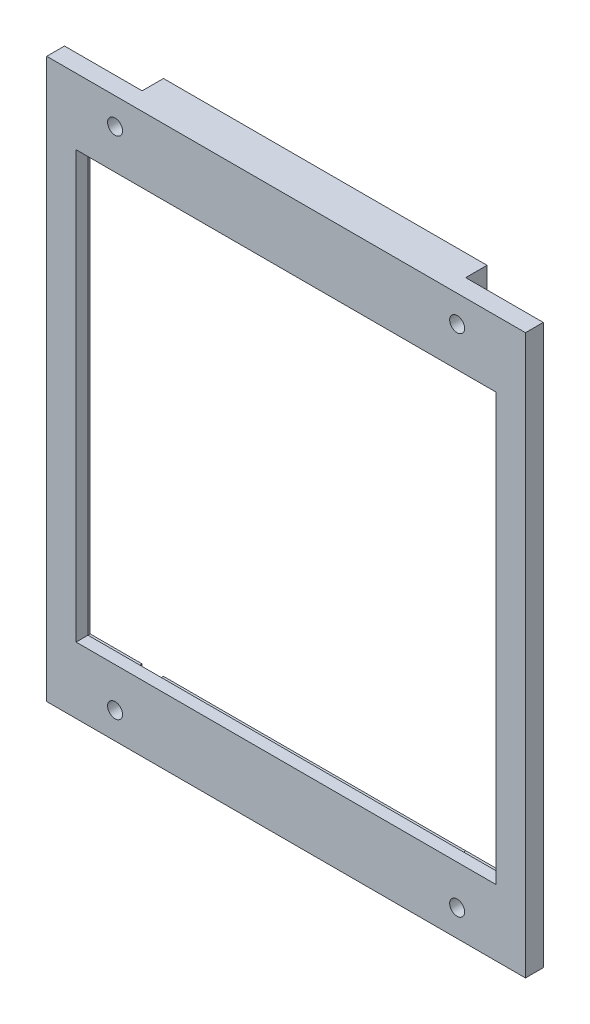
ISO-10303-21;
HEADER;
FILE_DESCRIPTION(('STEP AP214'),'2;1');
FILE_NAME('part.step','',(''),(''),'','','');
FILE_SCHEMA(('AUTOMOTIVE_DESIGN { 1 0 10303 214 1 1 1 1 }'));
ENDSEC;
DATA;
#1=APPLICATION_CONTEXT('core data for automotive mechanical design processes');
#2=APPLICATION_PROTOCOL_DEFINITION('international standard','automotive_design',2000,#1);
#3=PRODUCT_CONTEXT('',#1,'mechanical');
#4=PRODUCT('Part','Part','',(#3));
#5=PRODUCT_RELATED_PRODUCT_CATEGORY('part','',(#4));
#6=PRODUCT_DEFINITION_FORMATION('','',#4);
#7=PRODUCT_DEFINITION_CONTEXT('part definition',#1,'design');
#8=PRODUCT_DEFINITION('design','',#6,#7);
#9=PRODUCT_DEFINITION_SHAPE('','',#8);
#10=(LENGTH_UNIT() NAMED_UNIT(*) SI_UNIT(.MILLI.,.METRE.));
#11=(NAMED_UNIT(*) PLANE_ANGLE_UNIT() SI_UNIT($,.RADIAN.));
#12=(NAMED_UNIT(*) SI_UNIT($,.STERADIAN.) SOLID_ANGLE_UNIT());
#13=UNCERTAINTY_MEASURE_WITH_UNIT(LENGTH_MEASURE(1.E-05),#10,'distance_accuracy_value','');
#14=(GEOMETRIC_REPRESENTATION_CONTEXT(3) GLOBAL_UNCERTAINTY_ASSIGNED_CONTEXT((#13)) GLOBAL_UNIT_ASSIGNED_CONTEXT((#10,
#11,#12)) REPRESENTATION_CONTEXT('',''));
#15=CARTESIAN_POINT('',(0.,0.,0.));
#16=DIRECTION('',(0.,0.,1.));
#17=DIRECTION('',(1.,0.,0.));
#18=AXIS2_PLACEMENT_3D('',#15,#16,#17);
#19=CARTESIAN_POINT('',(0.,0.,6.1));
#20=DIRECTION('',(0.,0.,-1.));
#21=DIRECTION('',(-1.,0.,0.));
#22=AXIS2_PLACEMENT_3D('',#19,#20,#21);
#23=PLANE('',#22);
#24=DIRECTION('',(1.,0.,0.));
#25=VECTOR('',#24,1.);
#26=CARTESIAN_POINT('',(-60.025,60.925,6.1));
#27=LINE('',#26,#25);
#28=CARTESIAN_POINT('',(45.4728837140189,60.925,6.1));
#29=VERTEX_POINT('',#28);
#30=CARTESIAN_POINT('',(60.025,60.925,6.1));
#31=VERTEX_POINT('',#30);
#32=EDGE_CURVE('E262',#29,#31,#27,.T.);
#33=ORIENTED_EDGE('',*,*,#32,.F.);
#34=DIRECTION('',(0.,-1.,0.));
#35=VECTOR('',#34,1.);
#36=CARTESIAN_POINT('',(45.4728837140189,60.9,6.1));
#37=LINE('',#36,#35);
#38=CARTESIAN_POINT('',(45.4728837140189,66.95,6.1));
#39=VERTEX_POINT('',#38);
#40=EDGE_CURVE('E386',#39,#29,#37,.T.);
#41=ORIENTED_EDGE('',*,*,#40,.F.);
#42=DIRECTION('',(1.,0.,0.));
#43=VECTOR('',#42,1.);
#44=CARTESIAN_POINT('',(45.4728837140189,66.95,6.1));
#45=LINE('',#44,#43);
#46=CARTESIAN_POINT('',(45.45,66.95,6.1));
#47=VERTEX_POINT('',#46);
#48=EDGE_CURVE('E394',#47,#39,#45,.T.);
#49=ORIENTED_EDGE('',*,*,#48,.F.);
#50=DIRECTION('',(0.,-1.,0.));
#51=VECTOR('',#50,1.);
#52=CARTESIAN_POINT('',(45.45,78.5,6.09999999999999));
#53=LINE('',#52,#51);
#54=CARTESIAN_POINT('',(45.45,78.5,6.1));
#55=VERTEX_POINT('',#54);
#56=EDGE_CURVE('E313',#55,#47,#53,.T.);
#57=ORIENTED_EDGE('',*,*,#56,.F.);
#58=DIRECTION('',(-1.,0.,0.));
#59=VECTOR('',#58,1.);
#60=CARTESIAN_POINT('',(-67.2500000000002,78.5,6.1));
#61=LINE('',#60,#59);
#62=CARTESIAN_POINT('',(67.2500000000001,78.5,6.1));
#63=VERTEX_POINT('',#62);
#64=EDGE_CURVE('E512',#63,#55,#61,.T.);
#65=ORIENTED_EDGE('',*,*,#64,.F.);
#66=DIRECTION('',(0.,1.,0.));
#67=VECTOR('',#66,1.);
#68=CARTESIAN_POINT('',(67.2500000000001,78.5,6.1));
#69=LINE('',#68,#67);
#70=CARTESIAN_POINT('',(67.2500000000001,-78.5,6.1));
#71=VERTEX_POINT('',#70);
#72=EDGE_CURVE('E530',#71,#63,#69,.T.);
#73=ORIENTED_EDGE('',*,*,#72,.F.);
#74=DIRECTION('',(1.,0.,0.));
#75=VECTOR('',#74,1.);
#76=CARTESIAN_POINT('',(-67.2500000000002,-78.5,6.1));
#77=LINE('',#76,#75);
#78=CARTESIAN_POINT('',(45.45,-78.5,6.1));
#79=VERTEX_POINT('',#78);
#80=EDGE_CURVE('E525',#79,#71,#77,.T.);
#81=ORIENTED_EDGE('',*,*,#80,.F.);
#82=DIRECTION('',(0.,-1.,0.));
#83=VECTOR('',#82,1.);
#84=CARTESIAN_POINT('',(45.45,-78.5,6.09999999999999));
#85=LINE('',#84,#83);
#86=CARTESIAN_POINT('',(45.45,-66.95,6.1));
#87=VERTEX_POINT('',#86);
#88=EDGE_CURVE('E314',#87,#79,#85,.T.);
#89=ORIENTED_EDGE('',*,*,#88,.F.);
#90=DIRECTION('',(-1.,0.,0.));
#91=VECTOR('',#90,1.);
#92=CARTESIAN_POINT('',(45.4728837140189,-66.95,6.1));
#93=LINE('',#92,#91);
#94=CARTESIAN_POINT('',(45.4728837140189,-66.95,6.1));
#95=VERTEX_POINT('',#94);
#96=EDGE_CURVE('E443',#95,#87,#93,.T.);
#97=ORIENTED_EDGE('',*,*,#96,.F.);
#98=DIRECTION('',(0.,-1.,0.));
#99=VECTOR('',#98,1.);
#100=CARTESIAN_POINT('',(45.4728837140189,-60.9,6.1));
#101=LINE('',#100,#99);
#102=CARTESIAN_POINT('',(45.4728837140189,-60.925,6.1));
#103=VERTEX_POINT('',#102);
#104=EDGE_CURVE('E440',#103,#95,#101,.T.);
#105=ORIENTED_EDGE('',*,*,#104,.F.);
#106=DIRECTION('',(-1.,0.,0.));
#107=VECTOR('',#106,1.);
#108=CARTESIAN_POINT('',(60.025,-60.925,6.1));
#109=LINE('',#108,#107);
#110=CARTESIAN_POINT('',(60.025,-60.925,6.1));
#111=VERTEX_POINT('',#110);
#112=EDGE_CURVE('E272',#111,#103,#109,.T.);
#113=ORIENTED_EDGE('',*,*,#112,.F.);
#114=DIRECTION('',(0.,-1.,0.));
#115=VECTOR('',#114,1.);
#116=CARTESIAN_POINT('',(60.025,60.925,6.1));
#117=LINE('',#116,#115);
#118=EDGE_CURVE('E238',#31,#111,#117,.T.);
#119=ORIENTED_EDGE('',*,*,#118,.F.);
#120=EDGE_LOOP('',(#33,#41,#49,#57,#65,#73,#81,#89,#97,#105,#113,#119));
#121=FACE_BOUND('',#120,.T.);
#122=CARTESIAN_POINT('',(48.05,70.9904396437336,6.1));
#123=DIRECTION('',(0.,0.,1.));
#124=DIRECTION('',(1.,0.,0.));
#125=AXIS2_PLACEMENT_3D('',#122,#123,#124);
#126=CIRCLE('',#125,2.10000000000038);
#127=CARTESIAN_POINT('',(50.1500000000004,70.9904396437336,6.1));
#128=VERTEX_POINT('',#127);
#129=EDGE_CURVE('E495',#128,#128,#126,.T.);
#130=ORIENTED_EDGE('',*,*,#129,.T.);
#131=EDGE_LOOP('',(#130));
#132=FACE_BOUND('',#131,.T.);
#133=CARTESIAN_POINT('',(48.05,-70.9904396437336,6.1));
#134=DIRECTION('',(0.,0.,1.));
#135=DIRECTION('',(-1.,0.,0.));
#136=AXIS2_PLACEMENT_3D('',#133,#134,#135);
#137=CIRCLE('',#136,2.10000000000038);
#138=CARTESIAN_POINT('',(45.9499999999997,-70.9904396437336,6.1));
#139=VERTEX_POINT('',#138);
#140=EDGE_CURVE('E480',#139,#139,#137,.T.);
#141=ORIENTED_EDGE('',*,*,#140,.T.);
#142=EDGE_LOOP('',(#141));
#143=FACE_BOUND('',#142,.T.);
#144=ADVANCED_FACE('F45',(#121,#132,#143),#23,.T.);
#145=CARTESIAN_POINT('',(-59.,-59.9,11.1));
#146=DIRECTION('',(1.,0.,0.));
#147=DIRECTION('',(0.,0.,-1.));
#148=AXIS2_PLACEMENT_3D('',#145,#146,#147);
#149=PLANE('',#148);
#150=DIRECTION('',(0.,0.,-1.));
#151=VECTOR('',#150,1.);
#152=CARTESIAN_POINT('',(-59.,-59.9,11.1));
#153=LINE('',#152,#151);
#154=CARTESIAN_POINT('',(-59.,-59.9,11.1));
#155=VERTEX_POINT('',#154);
#156=CARTESIAN_POINT('',(-59.,-59.9,7.75));
#157=VERTEX_POINT('',#156);
#158=EDGE_CURVE('E471',#155,#157,#153,.T.);
#159=ORIENTED_EDGE('',*,*,#158,.T.);
#160=DIRECTION('',(0.,1.,0.));
#161=VECTOR('',#160,1.);
#162=CARTESIAN_POINT('',(-59.,-59.9,7.75));
#163=LINE('',#162,#161);
#164=CARTESIAN_POINT('',(-59.,59.9,7.75));
#165=VERTEX_POINT('',#164);
#166=EDGE_CURVE('E309',#157,#165,#163,.T.);
#167=ORIENTED_EDGE('',*,*,#166,.T.);
#168=DIRECTION('',(0.,0.,-1.));
#169=VECTOR('',#168,1.);
#170=CARTESIAN_POINT('',(-59.,59.9,11.1));
#171=LINE('',#170,#169);
#172=CARTESIAN_POINT('',(-59.,59.9,11.1));
#173=VERTEX_POINT('',#172);
#174=EDGE_CURVE('E459',#173,#165,#171,.T.);
#175=ORIENTED_EDGE('',*,*,#174,.F.);
#176=DIRECTION('',(0.,-1.,0.));
#177=VECTOR('',#176,1.);
#178=CARTESIAN_POINT('',(-59.,-59.9,11.1));
#179=LINE('',#178,#177);
#180=EDGE_CURVE('E417',#173,#155,#179,.T.);
#181=ORIENTED_EDGE('',*,*,#180,.T.);
#182=EDGE_LOOP('',(#159,#167,#175,#181));
#183=FACE_BOUND('',#182,.T.);
#184=ADVANCED_FACE('F656',(#183),#149,.T.);
#185=CARTESIAN_POINT('',(-59.,-59.9,11.1));
#186=DIRECTION('',(0.,1.,0.));
#187=DIRECTION('',(0.,0.,1.));
#188=AXIS2_PLACEMENT_3D('',#185,#186,#187);
#189=PLANE('',#188);
#190=DIRECTION('',(0.,0.,-1.));
#191=VECTOR('',#190,1.);
#192=CARTESIAN_POINT('',(59.,-59.9,11.1));
#193=LINE('',#192,#191);
#194=CARTESIAN_POINT('',(59.,-59.9,11.1));
#195=VERTEX_POINT('',#194);
#196=CARTESIAN_POINT('',(59.,-59.9,7.75));
#197=VERTEX_POINT('',#196);
#198=EDGE_CURVE('E467',#195,#197,#193,.T.);
#199=ORIENTED_EDGE('',*,*,#198,.T.);
#200=DIRECTION('',(-1.,0.,0.));
#201=VECTOR('',#200,1.);
#202=CARTESIAN_POINT('',(-59.,-59.9,7.75));
#203=LINE('',#202,#201);
#204=EDGE_CURVE('E305',#197,#157,#203,.T.);
#205=ORIENTED_EDGE('',*,*,#204,.T.);
#206=ORIENTED_EDGE('',*,*,#158,.F.);
#207=DIRECTION('',(1.,0.,0.));
#208=VECTOR('',#207,1.);
#209=CARTESIAN_POINT('',(-59.,-59.9,11.1));
#210=LINE('',#209,#208);
#211=EDGE_CURVE('E449',#155,#195,#210,.T.);
#212=ORIENTED_EDGE('',*,*,#211,.T.);
#213=EDGE_LOOP('',(#199,#205,#206,#212));
#214=FACE_BOUND('',#213,.T.);
#215=ADVANCED_FACE('F660',(#214),#189,.T.);
#216=CARTESIAN_POINT('',(59.,59.9,11.1));
#217=DIRECTION('',(-1.,0.,0.));
#218=DIRECTION('',(0.,0.,1.));
#219=AXIS2_PLACEMENT_3D('',#216,#217,#218);
#220=PLANE('',#219);
#221=DIRECTION('',(0.,0.,-1.));
#222=VECTOR('',#221,1.);
#223=CARTESIAN_POINT('',(59.,59.9,11.1));
#224=LINE('',#223,#222);
#225=CARTESIAN_POINT('',(59.,59.9,11.1));
#226=VERTEX_POINT('',#225);
#227=CARTESIAN_POINT('',(59.,59.9,7.75));
#228=VERTEX_POINT('',#227);
#229=EDGE_CURVE('E463',#226,#228,#224,.T.);
#230=ORIENTED_EDGE('',*,*,#229,.T.);
#231=DIRECTION('',(0.,-1.,0.));
#232=VECTOR('',#231,1.);
#233=CARTESIAN_POINT('',(59.,59.9,7.75));
#234=LINE('',#233,#232);
#235=EDGE_CURVE('E61',#228,#197,#234,.T.);
#236=ORIENTED_EDGE('',*,*,#235,.T.);
#237=ORIENTED_EDGE('',*,*,#198,.F.);
#238=DIRECTION('',(0.,1.,0.));
#239=VECTOR('',#238,1.);
#240=CARTESIAN_POINT('',(59.,59.9,11.1));
#241=LINE('',#240,#239);
#242=EDGE_CURVE('E452',#195,#226,#241,.T.);
#243=ORIENTED_EDGE('',*,*,#242,.T.);
#244=EDGE_LOOP('',(#230,#236,#237,#243));
#245=FACE_BOUND('',#244,.T.);
#246=ADVANCED_FACE('F674',(#245),#220,.T.);
#247=CARTESIAN_POINT('',(-59.,59.9,11.1));
#248=DIRECTION('',(0.,-1.,0.));
#249=DIRECTION('',(0.,0.,-1.));
#250=AXIS2_PLACEMENT_3D('',#247,#248,#249);
#251=PLANE('',#250);
#252=ORIENTED_EDGE('',*,*,#174,.T.);
#253=DIRECTION('',(1.,0.,0.));
#254=VECTOR('',#253,1.);
#255=CARTESIAN_POINT('',(-59.,59.9,7.75));
#256=LINE('',#255,#254);
#257=EDGE_CURVE('E11',#165,#228,#256,.T.);
#258=ORIENTED_EDGE('',*,*,#257,.T.);
#259=ORIENTED_EDGE('',*,*,#229,.F.);
#260=DIRECTION('',(-1.,0.,0.));
#261=VECTOR('',#260,1.);
#262=CARTESIAN_POINT('',(-59.,59.9,11.1));
#263=LINE('',#262,#261);
#264=EDGE_CURVE('E456',#226,#173,#263,.T.);
#265=ORIENTED_EDGE('',*,*,#264,.T.);
#266=EDGE_LOOP('',(#252,#258,#259,#265));
#267=FACE_BOUND('',#266,.T.);
#268=ADVANCED_FACE('F670',(#267),#251,.T.);
#269=CARTESIAN_POINT('',(0.,0.,11.1));
#270=DIRECTION('',(0.,0.,-1.));
#271=DIRECTION('',(-1.,0.,0.));
#272=AXIS2_PLACEMENT_3D('',#269,#270,#271);
#273=PLANE('',#272);
#274=CARTESIAN_POINT('',(-48.05,-70.9904396437336,11.1));
#275=DIRECTION('',(0.,0.,1.));
#276=DIRECTION('',(-1.,0.,0.));
#277=AXIS2_PLACEMENT_3D('',#274,#275,#276);
#278=CIRCLE('',#277,2.10000000000038);
#279=CARTESIAN_POINT('',(-50.1500000000004,-70.9904396437336,11.1));
#280=VERTEX_POINT('',#279);
#281=EDGE_CURVE('E476',#280,#280,#278,.T.);
#282=ORIENTED_EDGE('',*,*,#281,.F.);
#283=EDGE_LOOP('',(#282));
#284=FACE_BOUND('',#283,.T.);
#285=CARTESIAN_POINT('',(48.05,-70.9904396437336,11.1));
#286=DIRECTION('',(0.,0.,1.));
#287=DIRECTION('',(-1.,0.,0.));
#288=AXIS2_PLACEMENT_3D('',#285,#286,#287);
#289=CIRCLE('',#288,2.10000000000038);
#290=CARTESIAN_POINT('',(45.9499999999997,-70.9904396437336,11.1));
#291=VERTEX_POINT('',#290);
#292=EDGE_CURVE('E483',#291,#291,#289,.T.);
#293=ORIENTED_EDGE('',*,*,#292,.F.);
#294=EDGE_LOOP('',(#293));
#295=FACE_BOUND('',#294,.T.);
#296=CARTESIAN_POINT('',(-48.05,70.9904396437336,11.1));
#297=DIRECTION('',(0.,0.,1.));
#298=DIRECTION('',(1.,0.,0.));
#299=AXIS2_PLACEMENT_3D('',#296,#297,#298);
#300=CIRCLE('',#299,2.10000000000038);
#301=CARTESIAN_POINT('',(-45.9499999999996,70.9904396437336,11.1));
#302=VERTEX_POINT('',#301);
#303=EDGE_CURVE('E491',#302,#302,#300,.T.);
#304=ORIENTED_EDGE('',*,*,#303,.F.);
#305=EDGE_LOOP('',(#304));
#306=FACE_BOUND('',#305,.T.);
#307=CARTESIAN_POINT('',(48.05,70.9904396437336,11.1));
#308=DIRECTION('',(0.,0.,1.));
#309=DIRECTION('',(1.,0.,0.));
#310=AXIS2_PLACEMENT_3D('',#307,#308,#309);
#311=CIRCLE('',#310,2.10000000000038);
#312=CARTESIAN_POINT('',(50.1500000000004,70.9904396437336,11.1));
#313=VERTEX_POINT('',#312);
#314=EDGE_CURVE('E499',#313,#313,#311,.T.);
#315=ORIENTED_EDGE('',*,*,#314,.F.);
#316=EDGE_LOOP('',(#315));
#317=FACE_BOUND('',#316,.T.);
#318=DIRECTION('',(0.,-1.,0.));
#319=VECTOR('',#318,1.);
#320=CARTESIAN_POINT('',(-67.2500000000002,-78.5,11.1));
#321=LINE('',#320,#319);
#322=CARTESIAN_POINT('',(-67.2500000000002,78.5,11.1));
#323=VERTEX_POINT('',#322);
#324=CARTESIAN_POINT('',(-67.2500000000002,-78.5,11.1));
#325=VERTEX_POINT('',#324);
#326=EDGE_CURVE('E507',#323,#325,#321,.T.);
#327=ORIENTED_EDGE('',*,*,#326,.T.);
#328=DIRECTION('',(1.,0.,0.));
#329=VECTOR('',#328,1.);
#330=CARTESIAN_POINT('',(-67.2500000000002,-78.5,11.1));
#331=LINE('',#330,#329);
#332=CARTESIAN_POINT('',(67.2500000000001,-78.5,11.1));
#333=VERTEX_POINT('',#332);
#334=EDGE_CURVE('E511',#325,#333,#331,.T.);
#335=ORIENTED_EDGE('',*,*,#334,.T.);
#336=DIRECTION('',(0.,1.,0.));
#337=VECTOR('',#336,1.);
#338=CARTESIAN_POINT('',(67.2500000000001,78.5,11.1));
#339=LINE('',#338,#337);
#340=CARTESIAN_POINT('',(67.2500000000001,78.5,11.1));
#341=VERTEX_POINT('',#340);
#342=EDGE_CURVE('E515',#333,#341,#339,.T.);
#343=ORIENTED_EDGE('',*,*,#342,.T.);
#344=DIRECTION('',(-1.,0.,0.));
#345=VECTOR('',#344,1.);
#346=CARTESIAN_POINT('',(-67.2500000000002,78.5,11.1));
#347=LINE('',#346,#345);
#348=EDGE_CURVE('E518',#341,#323,#347,.T.);
#349=ORIENTED_EDGE('',*,*,#348,.T.);
#350=EDGE_LOOP('',(#327,#335,#343,#349));
#351=FACE_BOUND('',#350,.T.);
#352=ORIENTED_EDGE('',*,*,#180,.F.);
#353=ORIENTED_EDGE('',*,*,#264,.F.);
#354=ORIENTED_EDGE('',*,*,#242,.F.);
#355=ORIENTED_EDGE('',*,*,#211,.F.);
#356=EDGE_LOOP('',(#352,#353,#354,#355));
#357=FACE_BOUND('',#356,.T.);
#358=ADVANCED_FACE('F666',(#284,#295,#306,#317,#351,#357),#273,.F.);
#359=CARTESIAN_POINT('',(-60.025,60.925,6.1));
#360=VERTEX_POINT('',#359);
#361=CARTESIAN_POINT('',(-45.475,60.925,6.1));
#362=VERTEX_POINT('',#361);
#363=EDGE_CURVE('E68',#360,#362,#27,.T.);
#364=ORIENTED_EDGE('',*,*,#363,.F.);
#365=DIRECTION('',(0.,1.,0.));
#366=VECTOR('',#365,1.);
#367=CARTESIAN_POINT('',(-60.025,-60.925,6.1));
#368=LINE('',#367,#366);
#369=CARTESIAN_POINT('',(-60.025,-60.925,6.1));
#370=VERTEX_POINT('',#369);
#371=EDGE_CURVE('E275',#370,#360,#368,.T.);
#372=ORIENTED_EDGE('',*,*,#371,.F.);
#373=CARTESIAN_POINT('',(-45.475,-60.925,6.1));
#374=VERTEX_POINT('',#373);
#375=EDGE_CURVE('E271',#374,#370,#109,.T.);
#376=ORIENTED_EDGE('',*,*,#375,.F.);
#377=DIRECTION('',(0.,1.,0.));
#378=VECTOR('',#377,1.);
#379=CARTESIAN_POINT('',(-45.475,-66.95,6.1));
#380=LINE('',#379,#378);
#381=CARTESIAN_POINT('',(-45.475,-66.95,6.1));
#382=VERTEX_POINT('',#381);
#383=EDGE_CURVE('E398',#382,#374,#380,.T.);
#384=ORIENTED_EDGE('',*,*,#383,.F.);
#385=CARTESIAN_POINT('',(-45.45,-66.9499999999999,6.09999999999999));
#386=VERTEX_POINT('',#385);
#387=EDGE_CURVE('E430',#386,#382,#93,.T.);
#388=ORIENTED_EDGE('',*,*,#387,.F.);
#389=DIRECTION('',(0.,1.,0.));
#390=VECTOR('',#389,1.);
#391=CARTESIAN_POINT('',(-45.45,-66.9499999999999,6.09999999999999));
#392=LINE('',#391,#390);
#393=CARTESIAN_POINT('',(-45.45,-78.5,6.1));
#394=VERTEX_POINT('',#393);
#395=EDGE_CURVE('E318',#394,#386,#392,.T.);
#396=ORIENTED_EDGE('',*,*,#395,.F.);
#397=CARTESIAN_POINT('',(-67.2500000000002,-78.5,6.1));
#398=VERTEX_POINT('',#397);
#399=EDGE_CURVE('E526',#398,#394,#77,.T.);
#400=ORIENTED_EDGE('',*,*,#399,.F.);
#401=DIRECTION('',(0.,-1.,0.));
#402=VECTOR('',#401,1.);
#403=CARTESIAN_POINT('',(-67.2500000000002,-78.5,6.1));
#404=LINE('',#403,#402);
#405=CARTESIAN_POINT('',(-67.2500000000002,78.5,6.1));
#406=VERTEX_POINT('',#405);
#407=EDGE_CURVE('E503',#406,#398,#404,.T.);
#408=ORIENTED_EDGE('',*,*,#407,.F.);
#409=CARTESIAN_POINT('',(-45.45,78.5,6.10000000000002));
#410=VERTEX_POINT('',#409);
#411=EDGE_CURVE('E533',#410,#406,#61,.T.);
#412=ORIENTED_EDGE('',*,*,#411,.F.);
#413=DIRECTION('',(0.,1.,0.));
#414=VECTOR('',#413,1.);
#415=CARTESIAN_POINT('',(-45.45,66.9499999999999,6.09999999999999));
#416=LINE('',#415,#414);
#417=CARTESIAN_POINT('',(-45.45,66.95,6.1));
#418=VERTEX_POINT('',#417);
#419=EDGE_CURVE('E352',#418,#410,#416,.T.);
#420=ORIENTED_EDGE('',*,*,#419,.F.);
#421=CARTESIAN_POINT('',(-45.475,66.95,6.1));
#422=VERTEX_POINT('',#421);
#423=EDGE_CURVE('E390',#422,#418,#45,.T.);
#424=ORIENTED_EDGE('',*,*,#423,.F.);
#425=DIRECTION('',(0.,1.,0.));
#426=VECTOR('',#425,1.);
#427=CARTESIAN_POINT('',(-45.475,66.95,6.1));
#428=LINE('',#427,#426);
#429=EDGE_CURVE('E395',#362,#422,#428,.T.);
#430=ORIENTED_EDGE('',*,*,#429,.F.);
#431=EDGE_LOOP('',(#364,#372,#376,#384,#388,#396,#400,#408,#412,#420,#424,#430));
#432=FACE_BOUND('',#431,.T.);
#433=CARTESIAN_POINT('',(-48.05,70.9904396437336,6.1));
#434=DIRECTION('',(0.,0.,1.));
#435=DIRECTION('',(1.,0.,0.));
#436=AXIS2_PLACEMENT_3D('',#433,#434,#435);
#437=CIRCLE('',#436,2.10000000000038);
#438=CARTESIAN_POINT('',(-45.9499999999996,70.9904396437336,6.1));
#439=VERTEX_POINT('',#438);
#440=EDGE_CURVE('E487',#439,#439,#437,.T.);
#441=ORIENTED_EDGE('',*,*,#440,.T.);
#442=EDGE_LOOP('',(#441));
#443=FACE_BOUND('',#442,.T.);
#444=CARTESIAN_POINT('',(-48.05,-70.9904396437336,6.1));
#445=DIRECTION('',(0.,0.,1.));
#446=DIRECTION('',(-1.,0.,0.));
#447=AXIS2_PLACEMENT_3D('',#444,#445,#446);
#448=CIRCLE('',#447,2.10000000000038);
#449=CARTESIAN_POINT('',(-50.1500000000004,-70.9904396437336,6.1));
#450=VERTEX_POINT('',#449);
#451=EDGE_CURVE('E475',#450,#450,#448,.T.);
#452=ORIENTED_EDGE('',*,*,#451,.T.);
#453=EDGE_LOOP('',(#452));
#454=FACE_BOUND('',#453,.T.);
#455=ADVANCED_FACE('F590',(#432,#443,#454),#23,.T.);
#456=CARTESIAN_POINT('',(-67.2500000000002,-78.5,11.1));
#457=DIRECTION('',(1.,0.,0.));
#458=DIRECTION('',(0.,0.,-1.));
#459=AXIS2_PLACEMENT_3D('',#456,#457,#458);
#460=PLANE('',#459);
#461=ORIENTED_EDGE('',*,*,#407,.T.);
#462=DIRECTION('',(0.,0.,-1.));
#463=VECTOR('',#462,1.);
#464=CARTESIAN_POINT('',(-67.2500000000002,-78.5,11.1));
#465=LINE('',#464,#463);
#466=EDGE_CURVE('E548',#325,#398,#465,.T.);
#467=ORIENTED_EDGE('',*,*,#466,.F.);
#468=ORIENTED_EDGE('',*,*,#326,.F.);
#469=DIRECTION('',(0.,0.,-1.));
#470=VECTOR('',#469,1.);
#471=CARTESIAN_POINT('',(-67.2500000000002,78.5,11.1));
#472=LINE('',#471,#470);
#473=EDGE_CURVE('E521',#323,#406,#472,.T.);
#474=ORIENTED_EDGE('',*,*,#473,.T.);
#475=EDGE_LOOP('',(#461,#467,#468,#474));
#476=FACE_BOUND('',#475,.T.);
#477=ADVANCED_FACE('F47',(#476),#460,.F.);
#478=CARTESIAN_POINT('',(-67.2500000000002,-78.5,11.1));
#479=DIRECTION('',(0.,1.,0.));
#480=DIRECTION('',(0.,0.,1.));
#481=AXIS2_PLACEMENT_3D('',#478,#479,#480);
#482=PLANE('',#481);
#483=ORIENTED_EDGE('',*,*,#399,.T.);
#484=DIRECTION('',(0.,0.,-1.));
#485=VECTOR('',#484,1.);
#486=CARTESIAN_POINT('',(-45.45,-78.5,97.7308490629657));
#487=LINE('',#486,#485);
#488=CARTESIAN_POINT('',(-45.45,-78.5,0.0999999999999998));
#489=VERTEX_POINT('',#488);
#490=EDGE_CURVE('E319',#394,#489,#487,.T.);
#491=ORIENTED_EDGE('',*,*,#490,.T.);
#492=DIRECTION('',(1.,0.,0.));
#493=VECTOR('',#492,1.);
#494=CARTESIAN_POINT('',(-45.45,-78.5,0.0999999999999998));
#495=LINE('',#494,#493);
#496=CARTESIAN_POINT('',(45.45,-78.5,0.0999999999999998));
#497=VERTEX_POINT('',#496);
#498=EDGE_CURVE('E328',#489,#497,#495,.T.);
#499=ORIENTED_EDGE('',*,*,#498,.T.);
#500=DIRECTION('',(0.,0.,-1.));
#501=VECTOR('',#500,1.);
#502=CARTESIAN_POINT('',(45.45,-78.5,97.7308490629657));
#503=LINE('',#502,#501);
#504=EDGE_CURVE('E347',#79,#497,#503,.T.);
#505=ORIENTED_EDGE('',*,*,#504,.F.);
#506=ORIENTED_EDGE('',*,*,#80,.T.);
#507=DIRECTION('',(0.,0.,-1.));
#508=VECTOR('',#507,1.);
#509=CARTESIAN_POINT('',(67.2500000000001,-78.5,11.1));
#510=LINE('',#509,#508);
#511=EDGE_CURVE('E544',#333,#71,#510,.T.);
#512=ORIENTED_EDGE('',*,*,#511,.F.);
#513=ORIENTED_EDGE('',*,*,#334,.F.);
#514=ORIENTED_EDGE('',*,*,#466,.T.);
#515=EDGE_LOOP('',(#483,#491,#499,#505,#506,#512,#513,#514));
#516=FACE_BOUND('',#515,.T.);
#517=ADVANCED_FACE('F594',(#516),#482,.F.);
#518=CARTESIAN_POINT('',(67.2500000000001,78.5,11.1));
#519=DIRECTION('',(-1.,0.,0.));
#520=DIRECTION('',(0.,0.,1.));
#521=AXIS2_PLACEMENT_3D('',#518,#519,#520);
#522=PLANE('',#521);
#523=ORIENTED_EDGE('',*,*,#72,.T.);
#524=DIRECTION('',(0.,0.,-1.));
#525=VECTOR('',#524,1.);
#526=CARTESIAN_POINT('',(67.2500000000001,78.5,11.1));
#527=LINE('',#526,#525);
#528=EDGE_CURVE('E540',#341,#63,#527,.T.);
#529=ORIENTED_EDGE('',*,*,#528,.F.);
#530=ORIENTED_EDGE('',*,*,#342,.F.);
#531=ORIENTED_EDGE('',*,*,#511,.T.);
#532=EDGE_LOOP('',(#523,#529,#530,#531));
#533=FACE_BOUND('',#532,.T.);
#534=ADVANCED_FACE('F638',(#533),#522,.F.);
#535=CARTESIAN_POINT('',(-67.2500000000002,78.5,11.1));
#536=DIRECTION('',(0.,-1.,0.));
#537=DIRECTION('',(0.,0.,-1.));
#538=AXIS2_PLACEMENT_3D('',#535,#536,#537);
#539=PLANE('',#538);
#540=ORIENTED_EDGE('',*,*,#64,.T.);
#541=DIRECTION('',(0.,0.,-1.));
#542=VECTOR('',#541,1.);
#543=CARTESIAN_POINT('',(45.45,78.5,97.7308490629657));
#544=LINE('',#543,#542);
#545=CARTESIAN_POINT('',(45.45,78.5,0.0999999999999998));
#546=VERTEX_POINT('',#545);
#547=EDGE_CURVE('E359',#55,#546,#544,.T.);
#548=ORIENTED_EDGE('',*,*,#547,.T.);
#549=DIRECTION('',(-1.,0.,0.));
#550=VECTOR('',#549,1.);
#551=CARTESIAN_POINT('',(-45.45,78.5,0.0999999999999998));
#552=LINE('',#551,#550);
#553=CARTESIAN_POINT('',(-45.45,78.5,0.0999999999999998));
#554=VERTEX_POINT('',#553);
#555=EDGE_CURVE('E372',#546,#554,#552,.T.);
#556=ORIENTED_EDGE('',*,*,#555,.T.);
#557=DIRECTION('',(0.,0.,-1.));
#558=VECTOR('',#557,1.);
#559=CARTESIAN_POINT('',(-45.45,78.5,97.7308490629657));
#560=LINE('',#559,#558);
#561=EDGE_CURVE('E362',#410,#554,#560,.T.);
#562=ORIENTED_EDGE('',*,*,#561,.F.);
#563=ORIENTED_EDGE('',*,*,#411,.T.);
#564=ORIENTED_EDGE('',*,*,#473,.F.);
#565=ORIENTED_EDGE('',*,*,#348,.F.);
#566=ORIENTED_EDGE('',*,*,#528,.T.);
#567=EDGE_LOOP('',(#540,#548,#556,#562,#563,#564,#565,#566));
#568=FACE_BOUND('',#567,.T.);
#569=ADVANCED_FACE('F604',(#568),#539,.F.);
#570=CARTESIAN_POINT('',(48.05,70.9904396437336,11.1));
#571=DIRECTION('',(0.,0.,-1.));
#572=DIRECTION('',(-1.,0.,0.));
#573=AXIS2_PLACEMENT_3D('',#570,#571,#572);
#574=CYLINDRICAL_SURFACE('',#573,2.10000000000038);
#575=ORIENTED_EDGE('',*,*,#314,.T.);
#576=EDGE_LOOP('',(#575));
#577=FACE_BOUND('',#576,.T.);
#578=ORIENTED_EDGE('',*,*,#129,.F.);
#579=EDGE_LOOP('',(#578));
#580=FACE_BOUND('',#579,.T.);
#581=ADVANCED_FACE('F680',(#577,#580),#574,.F.);
#582=CARTESIAN_POINT('',(-48.05,70.9904396437336,11.1));
#583=DIRECTION('',(0.,0.,-1.));
#584=DIRECTION('',(-1.,0.,0.));
#585=AXIS2_PLACEMENT_3D('',#582,#583,#584);
#586=CYLINDRICAL_SURFACE('',#585,2.10000000000038);
#587=ORIENTED_EDGE('',*,*,#303,.T.);
#588=EDGE_LOOP('',(#587));
#589=FACE_BOUND('',#588,.T.);
#590=ORIENTED_EDGE('',*,*,#440,.F.);
#591=EDGE_LOOP('',(#590));
#592=FACE_BOUND('',#591,.T.);
#593=ADVANCED_FACE('F683',(#589,#592),#586,.F.);
#594=CARTESIAN_POINT('',(48.05,-70.9904396437336,11.1));
#595=DIRECTION('',(0.,0.,-1.));
#596=DIRECTION('',(-1.,0.,0.));
#597=AXIS2_PLACEMENT_3D('',#594,#595,#596);
#598=CYLINDRICAL_SURFACE('',#597,2.10000000000038);
#599=ORIENTED_EDGE('',*,*,#292,.T.);
#600=EDGE_LOOP('',(#599));
#601=FACE_BOUND('',#600,.T.);
#602=ORIENTED_EDGE('',*,*,#140,.F.);
#603=EDGE_LOOP('',(#602));
#604=FACE_BOUND('',#603,.T.);
#605=ADVANCED_FACE('F687',(#601,#604),#598,.F.);
#606=CARTESIAN_POINT('',(-48.05,-70.9904396437336,11.1));
#607=DIRECTION('',(0.,0.,-1.));
#608=DIRECTION('',(-1.,0.,0.));
#609=AXIS2_PLACEMENT_3D('',#606,#607,#608);
#610=CYLINDRICAL_SURFACE('',#609,2.10000000000038);
#611=ORIENTED_EDGE('',*,*,#281,.T.);
#612=EDGE_LOOP('',(#611));
#613=FACE_BOUND('',#612,.T.);
#614=ORIENTED_EDGE('',*,*,#451,.F.);
#615=EDGE_LOOP('',(#614));
#616=FACE_BOUND('',#615,.T.);
#617=ADVANCED_FACE('F691',(#613,#616),#610,.F.);
#618=CARTESIAN_POINT('',(0.,-30.45,7.67));
#619=DIRECTION('',(0.,0.,1.));
#620=DIRECTION('',(0.,-1.,0.));
#621=AXIS2_PLACEMENT_3D('',#618,#619,#620);
#622=PLANE('',#621);
#623=DIRECTION('',(0.,1.,0.));
#624=VECTOR('',#623,1.);
#625=CARTESIAN_POINT('',(-45.475,-66.95,7.67));
#626=LINE('',#625,#624);
#627=CARTESIAN_POINT('',(-45.475,-66.95,7.67));
#628=VERTEX_POINT('',#627);
#629=CARTESIAN_POINT('',(-45.475,-60.925,7.67));
#630=VERTEX_POINT('',#629);
#631=EDGE_CURVE('E323',#628,#630,#626,.T.);
#632=ORIENTED_EDGE('',*,*,#631,.T.);
#633=DIRECTION('',(1.,0.,0.));
#634=VECTOR('',#633,1.);
#635=CARTESIAN_POINT('',(0.,-60.925,7.67));
#636=LINE('',#635,#634);
#637=CARTESIAN_POINT('',(45.4728837140189,-60.925,7.67));
#638=VERTEX_POINT('',#637);
#639=EDGE_CURVE('E295',#630,#638,#636,.T.);
#640=ORIENTED_EDGE('',*,*,#639,.T.);
#641=DIRECTION('',(0.,-1.,0.));
#642=VECTOR('',#641,1.);
#643=CARTESIAN_POINT('',(45.4728837140189,-60.9,7.67));
#644=LINE('',#643,#642);
#645=CARTESIAN_POINT('',(45.4728837140189,-66.95,7.67));
#646=VERTEX_POINT('',#645);
#647=EDGE_CURVE('E422',#638,#646,#644,.T.);
#648=ORIENTED_EDGE('',*,*,#647,.T.);
#649=DIRECTION('',(-1.,0.,0.));
#650=VECTOR('',#649,1.);
#651=CARTESIAN_POINT('',(45.4728837140189,-66.95,7.67));
#652=LINE('',#651,#650);
#653=EDGE_CURVE('E423',#646,#628,#652,.T.);
#654=ORIENTED_EDGE('',*,*,#653,.T.);
#655=EDGE_LOOP('',(#632,#640,#648,#654));
#656=FACE_BOUND('',#655,.T.);
#657=ADVANCED_FACE('F562',(#656),#622,.F.);
#658=CARTESIAN_POINT('',(45.4728837140189,-60.9,98.818889472438));
#659=DIRECTION('',(1.,0.,0.));
#660=DIRECTION('',(0.,0.,-1.));
#661=AXIS2_PLACEMENT_3D('',#658,#659,#660);
#662=PLANE('',#661);
#663=ORIENTED_EDGE('',*,*,#647,.F.);
#664=DIRECTION('',(0.,0.,-1.));
#665=VECTOR('',#664,1.);
#666=CARTESIAN_POINT('',(45.4728837140189,-60.925,98.818889472438));
#667=LINE('',#666,#665);
#668=EDGE_CURVE('E299',#638,#103,#667,.T.);
#669=ORIENTED_EDGE('',*,*,#668,.T.);
#670=ORIENTED_EDGE('',*,*,#104,.T.);
#671=DIRECTION('',(0.,0.,-1.));
#672=VECTOR('',#671,1.);
#673=CARTESIAN_POINT('',(45.4728837140189,-66.95,98.818889472438));
#674=LINE('',#673,#672);
#675=EDGE_CURVE('E418',#646,#95,#674,.T.);
#676=ORIENTED_EDGE('',*,*,#675,.F.);
#677=EDGE_LOOP('',(#663,#669,#670,#676));
#678=FACE_BOUND('',#677,.T.);
#679=ADVANCED_FACE('F570',(#678),#662,.F.);
#680=CARTESIAN_POINT('',(45.4728837140189,-66.95,98.818889472438));
#681=DIRECTION('',(0.,-1.,0.));
#682=DIRECTION('',(0.,0.,-1.));
#683=AXIS2_PLACEMENT_3D('',#680,#681,#682);
#684=PLANE('',#683);
#685=ORIENTED_EDGE('',*,*,#675,.T.);
#686=ORIENTED_EDGE('',*,*,#96,.T.);
#687=DIRECTION('',(0.,0.,-1.));
#688=VECTOR('',#687,1.);
#689=CARTESIAN_POINT('',(45.4500000000001,-66.9499999999999,97.7308490629657));
#690=LINE('',#689,#688);
#691=CARTESIAN_POINT('',(45.4500000000001,-66.9499999999999,0.0999999999999998));
#692=VERTEX_POINT('',#691);
#693=EDGE_CURVE('E344',#87,#692,#690,.T.);
#694=ORIENTED_EDGE('',*,*,#693,.T.);
#695=DIRECTION('',(-1.,0.,0.));
#696=VECTOR('',#695,1.);
#697=CARTESIAN_POINT('',(45.4500000000001,-66.9499999999999,0.0999999999999998));
#698=LINE('',#697,#696);
#699=CARTESIAN_POINT('',(-45.45,-66.9499999999999,0.0999999999999998));
#700=VERTEX_POINT('',#699);
#701=EDGE_CURVE('E337',#692,#700,#698,.T.);
#702=ORIENTED_EDGE('',*,*,#701,.T.);
#703=DIRECTION('',(0.,0.,-1.));
#704=VECTOR('',#703,1.);
#705=CARTESIAN_POINT('',(-45.45,-66.9499999999999,97.7308490629657));
#706=LINE('',#705,#704);
#707=EDGE_CURVE('E341',#386,#700,#706,.T.);
#708=ORIENTED_EDGE('',*,*,#707,.F.);
#709=ORIENTED_EDGE('',*,*,#387,.T.);
#710=DIRECTION('',(0.,0.,-1.));
#711=VECTOR('',#710,1.);
#712=CARTESIAN_POINT('',(-45.475,-66.95,98.818889472438));
#713=LINE('',#712,#711);
#714=EDGE_CURVE('E424',#628,#382,#713,.T.);
#715=ORIENTED_EDGE('',*,*,#714,.F.);
#716=ORIENTED_EDGE('',*,*,#653,.F.);
#717=EDGE_LOOP('',(#685,#686,#694,#702,#708,#709,#715,#716));
#718=FACE_BOUND('',#717,.T.);
#719=ADVANCED_FACE('F567',(#718),#684,.F.);
#720=CARTESIAN_POINT('',(-45.475,-66.95,98.818889472438));
#721=DIRECTION('',(-1.,0.,0.));
#722=DIRECTION('',(0.,0.,1.));
#723=AXIS2_PLACEMENT_3D('',#720,#721,#722);
#724=PLANE('',#723);
#725=ORIENTED_EDGE('',*,*,#383,.T.);
#726=DIRECTION('',(0.,0.,1.));
#727=VECTOR('',#726,1.);
#728=CARTESIAN_POINT('',(-45.475,-60.925,98.818889472438));
#729=LINE('',#728,#727);
#730=EDGE_CURVE('E54',#374,#630,#729,.T.);
#731=ORIENTED_EDGE('',*,*,#730,.T.);
#732=ORIENTED_EDGE('',*,*,#631,.F.);
#733=ORIENTED_EDGE('',*,*,#714,.T.);
#734=EDGE_LOOP('',(#725,#731,#732,#733));
#735=FACE_BOUND('',#734,.T.);
#736=ADVANCED_FACE('F557',(#735),#724,.F.);
#737=CARTESIAN_POINT('',(0.,-30.45,7.67));
#738=DIRECTION('',(0.,0.,1.));
#739=DIRECTION('',(0.,-1.,0.));
#740=AXIS2_PLACEMENT_3D('',#737,#738,#739);
#741=PLANE('',#740);
#742=DIRECTION('',(0.,-1.,0.));
#743=VECTOR('',#742,1.);
#744=CARTESIAN_POINT('',(45.4728837140189,60.9,7.67));
#745=LINE('',#744,#743);
#746=CARTESIAN_POINT('',(45.4728837140189,66.95,7.67));
#747=VERTEX_POINT('',#746);
#748=CARTESIAN_POINT('',(45.4728837140189,60.925,7.67));
#749=VERTEX_POINT('',#748);
#750=EDGE_CURVE('E407',#747,#749,#745,.T.);
#751=ORIENTED_EDGE('',*,*,#750,.T.);
#752=DIRECTION('',(-1.,0.,0.));
#753=VECTOR('',#752,1.);
#754=CARTESIAN_POINT('',(0.,60.925,7.67));
#755=LINE('',#754,#753);
#756=CARTESIAN_POINT('',(-45.475,60.925,7.67));
#757=VERTEX_POINT('',#756);
#758=EDGE_CURVE('E282',#749,#757,#755,.T.);
#759=ORIENTED_EDGE('',*,*,#758,.T.);
#760=DIRECTION('',(0.,1.,0.));
#761=VECTOR('',#760,1.);
#762=CARTESIAN_POINT('',(-45.475,66.95,7.67));
#763=LINE('',#762,#761);
#764=CARTESIAN_POINT('',(-45.475,66.95,7.67));
#765=VERTEX_POINT('',#764);
#766=EDGE_CURVE('E403',#757,#765,#763,.T.);
#767=ORIENTED_EDGE('',*,*,#766,.T.);
#768=DIRECTION('',(1.,0.,0.));
#769=VECTOR('',#768,1.);
#770=CARTESIAN_POINT('',(45.4728837140189,66.95,7.67));
#771=LINE('',#770,#769);
#772=EDGE_CURVE('E389',#765,#747,#771,.T.);
#773=ORIENTED_EDGE('',*,*,#772,.T.);
#774=EDGE_LOOP('',(#751,#759,#767,#773));
#775=FACE_BOUND('',#774,.T.);
#776=ADVANCED_FACE('F623',(#775),#741,.F.);
#777=CARTESIAN_POINT('',(45.4728837140189,66.95,98.818889472438));
#778=DIRECTION('',(0.,1.,0.));
#779=DIRECTION('',(0.,0.,1.));
#780=AXIS2_PLACEMENT_3D('',#777,#778,#779);
#781=PLANE('',#780);
#782=DIRECTION('',(0.,0.,-1.));
#783=VECTOR('',#782,1.);
#784=CARTESIAN_POINT('',(-45.475,66.95,98.818889472438));
#785=LINE('',#784,#783);
#786=EDGE_CURVE('E406',#765,#422,#785,.T.);
#787=ORIENTED_EDGE('',*,*,#786,.T.);
#788=ORIENTED_EDGE('',*,*,#423,.T.);
#789=DIRECTION('',(0.,0.,-1.));
#790=VECTOR('',#789,1.);
#791=CARTESIAN_POINT('',(-45.45,66.9499999999999,97.7308490629657));
#792=LINE('',#791,#790);
#793=CARTESIAN_POINT('',(-45.45,66.9499999999999,0.0999999999999998));
#794=VERTEX_POINT('',#793);
#795=EDGE_CURVE('E365',#418,#794,#792,.T.);
#796=ORIENTED_EDGE('',*,*,#795,.T.);
#797=DIRECTION('',(1.,0.,0.));
#798=VECTOR('',#797,1.);
#799=CARTESIAN_POINT('',(45.4500000000001,66.9499999999999,0.0999999999999998));
#800=LINE('',#799,#798);
#801=CARTESIAN_POINT('',(45.4500000000001,66.9499999999999,0.0999999999999998));
#802=VERTEX_POINT('',#801);
#803=EDGE_CURVE('E329',#794,#802,#800,.T.);
#804=ORIENTED_EDGE('',*,*,#803,.T.);
#805=DIRECTION('',(0.,0.,-1.));
#806=VECTOR('',#805,1.);
#807=CARTESIAN_POINT('',(45.4500000000001,66.9499999999999,97.7308490629657));
#808=LINE('',#807,#806);
#809=EDGE_CURVE('E356',#47,#802,#808,.T.);
#810=ORIENTED_EDGE('',*,*,#809,.F.);
#811=ORIENTED_EDGE('',*,*,#48,.T.);
#812=DIRECTION('',(0.,0.,-1.));
#813=VECTOR('',#812,1.);
#814=CARTESIAN_POINT('',(45.4728837140189,66.95,98.818889472438));
#815=LINE('',#814,#813);
#816=EDGE_CURVE('E402',#747,#39,#815,.T.);
#817=ORIENTED_EDGE('',*,*,#816,.F.);
#818=ORIENTED_EDGE('',*,*,#772,.F.);
#819=EDGE_LOOP('',(#787,#788,#796,#804,#810,#811,#817,#818));
#820=FACE_BOUND('',#819,.T.);
#821=ADVANCED_FACE('F612',(#820),#781,.F.);
#822=CARTESIAN_POINT('',(45.4728837140189,60.9,98.818889472438));
#823=DIRECTION('',(1.,0.,0.));
#824=DIRECTION('',(0.,0.,-1.));
#825=AXIS2_PLACEMENT_3D('',#822,#823,#824);
#826=PLANE('',#825);
#827=ORIENTED_EDGE('',*,*,#40,.T.);
#828=DIRECTION('',(0.,0.,1.));
#829=VECTOR('',#828,1.);
#830=CARTESIAN_POINT('',(45.4728837140189,60.925,98.818889472438));
#831=LINE('',#830,#829);
#832=EDGE_CURVE('E291',#29,#749,#831,.T.);
#833=ORIENTED_EDGE('',*,*,#832,.T.);
#834=ORIENTED_EDGE('',*,*,#750,.F.);
#835=ORIENTED_EDGE('',*,*,#816,.T.);
#836=EDGE_LOOP('',(#827,#833,#834,#835));
#837=FACE_BOUND('',#836,.T.);
#838=ADVANCED_FACE('F626',(#837),#826,.F.);
#839=CARTESIAN_POINT('',(-45.475,66.95,98.818889472438));
#840=DIRECTION('',(-1.,0.,0.));
#841=DIRECTION('',(0.,0.,1.));
#842=AXIS2_PLACEMENT_3D('',#839,#840,#841);
#843=PLANE('',#842);
#844=ORIENTED_EDGE('',*,*,#766,.F.);
#845=DIRECTION('',(0.,0.,-1.));
#846=VECTOR('',#845,1.);
#847=CARTESIAN_POINT('',(-45.475,60.925,98.818889472438));
#848=LINE('',#847,#846);
#849=EDGE_CURVE('E552',#757,#362,#848,.T.);
#850=ORIENTED_EDGE('',*,*,#849,.T.);
#851=ORIENTED_EDGE('',*,*,#429,.T.);
#852=ORIENTED_EDGE('',*,*,#786,.F.);
#853=EDGE_LOOP('',(#844,#850,#851,#852));
#854=FACE_BOUND('',#853,.T.);
#855=ADVANCED_FACE('F620',(#854),#843,.F.);
#856=CARTESIAN_POINT('',(0.,0.,0.0999999999999998));
#857=DIRECTION('',(0.,0.,-1.));
#858=DIRECTION('',(-1.,0.,0.));
#859=AXIS2_PLACEMENT_3D('',#856,#857,#858);
#860=PLANE('',#859);
#861=ORIENTED_EDGE('',*,*,#803,.F.);
#862=DIRECTION('',(0.,-1.,0.));
#863=VECTOR('',#862,1.);
#864=CARTESIAN_POINT('',(-45.45,66.9499999999999,0.0999999999999998));
#865=LINE('',#864,#863);
#866=EDGE_CURVE('E368',#554,#794,#865,.T.);
#867=ORIENTED_EDGE('',*,*,#866,.F.);
#868=ORIENTED_EDGE('',*,*,#555,.F.);
#869=DIRECTION('',(0.,1.,0.));
#870=VECTOR('',#869,1.);
#871=CARTESIAN_POINT('',(45.45,78.5,0.0999999999999998));
#872=LINE('',#871,#870);
#873=EDGE_CURVE('E376',#802,#546,#872,.T.);
#874=ORIENTED_EDGE('',*,*,#873,.F.);
#875=EDGE_LOOP('',(#861,#867,#868,#874));
#876=FACE_BOUND('',#875,.T.);
#877=ADVANCED_FACE('F647',(#876),#860,.T.);
#878=CARTESIAN_POINT('',(-45.45,66.9499999999999,97.7308490629657));
#879=DIRECTION('',(1.,0.,0.));
#880=DIRECTION('',(0.,0.,-1.));
#881=AXIS2_PLACEMENT_3D('',#878,#879,#880);
#882=PLANE('',#881);
#883=ORIENTED_EDGE('',*,*,#795,.F.);
#884=ORIENTED_EDGE('',*,*,#419,.T.);
#885=ORIENTED_EDGE('',*,*,#561,.T.);
#886=ORIENTED_EDGE('',*,*,#866,.T.);
#887=EDGE_LOOP('',(#883,#884,#885,#886));
#888=FACE_BOUND('',#887,.T.);
#889=ADVANCED_FACE('F609',(#888),#882,.F.);
#890=CARTESIAN_POINT('',(45.45,78.5,97.7308490629657));
#891=DIRECTION('',(-1.,0.,0.));
#892=DIRECTION('',(0.,-1.,0.));
#893=AXIS2_PLACEMENT_3D('',#890,#891,#892);
#894=PLANE('',#893);
#895=ORIENTED_EDGE('',*,*,#547,.F.);
#896=ORIENTED_EDGE('',*,*,#56,.T.);
#897=ORIENTED_EDGE('',*,*,#809,.T.);
#898=ORIENTED_EDGE('',*,*,#873,.T.);
#899=EDGE_LOOP('',(#895,#896,#897,#898));
#900=FACE_BOUND('',#899,.T.);
#901=ADVANCED_FACE('F644',(#900),#894,.F.);
#902=CARTESIAN_POINT('',(0.,0.,0.0999999999999998));
#903=DIRECTION('',(0.,0.,1.));
#904=DIRECTION('',(1.,0.,0.));
#905=AXIS2_PLACEMENT_3D('',#902,#903,#904);
#906=PLANE('',#905);
#907=DIRECTION('',(0.,-1.,0.));
#908=VECTOR('',#907,1.);
#909=CARTESIAN_POINT('',(-45.45,-66.9499999999999,0.0999999999999998));
#910=LINE('',#909,#908);
#911=EDGE_CURVE('E324',#700,#489,#910,.T.);
#912=ORIENTED_EDGE('',*,*,#911,.F.);
#913=ORIENTED_EDGE('',*,*,#701,.F.);
#914=DIRECTION('',(0.,1.,0.));
#915=VECTOR('',#914,1.);
#916=CARTESIAN_POINT('',(45.45,-78.5,0.0999999999999998));
#917=LINE('',#916,#915);
#918=EDGE_CURVE('E333',#497,#692,#917,.T.);
#919=ORIENTED_EDGE('',*,*,#918,.F.);
#920=ORIENTED_EDGE('',*,*,#498,.F.);
#921=EDGE_LOOP('',(#912,#913,#919,#920));
#922=FACE_BOUND('',#921,.T.);
#923=ADVANCED_FACE('F584',(#922),#906,.F.);
#924=CARTESIAN_POINT('',(45.45,-78.5,97.7308490629657));
#925=DIRECTION('',(-1.,0.,0.));
#926=DIRECTION('',(0.,-1.,0.));
#927=AXIS2_PLACEMENT_3D('',#924,#925,#926);
#928=PLANE('',#927);
#929=ORIENTED_EDGE('',*,*,#693,.F.);
#930=ORIENTED_EDGE('',*,*,#88,.T.);
#931=ORIENTED_EDGE('',*,*,#504,.T.);
#932=ORIENTED_EDGE('',*,*,#918,.T.);
#933=EDGE_LOOP('',(#929,#930,#931,#932));
#934=FACE_BOUND('',#933,.T.);
#935=ADVANCED_FACE('F577',(#934),#928,.F.);
#936=CARTESIAN_POINT('',(-45.45,-66.9499999999999,97.7308490629657));
#937=DIRECTION('',(1.,0.,0.));
#938=DIRECTION('',(0.,0.,-1.));
#939=AXIS2_PLACEMENT_3D('',#936,#937,#938);
#940=PLANE('',#939);
#941=ORIENTED_EDGE('',*,*,#490,.F.);
#942=ORIENTED_EDGE('',*,*,#395,.T.);
#943=ORIENTED_EDGE('',*,*,#707,.T.);
#944=ORIENTED_EDGE('',*,*,#911,.T.);
#945=EDGE_LOOP('',(#941,#942,#943,#944));
#946=FACE_BOUND('',#945,.T.);
#947=ADVANCED_FACE('F588',(#946),#940,.F.);
#948=CARTESIAN_POINT('',(60.025,-60.925,7.75));
#949=DIRECTION('',(0.,-1.,0.));
#950=DIRECTION('',(0.,0.,-1.));
#951=AXIS2_PLACEMENT_3D('',#948,#949,#950);
#952=PLANE('',#951);
#953=ORIENTED_EDGE('',*,*,#639,.F.);
#954=ORIENTED_EDGE('',*,*,#730,.F.);
#955=ORIENTED_EDGE('',*,*,#375,.T.);
#956=DIRECTION('',(0.,0.,-1.));
#957=VECTOR('',#956,1.);
#958=CARTESIAN_POINT('',(-60.025,-60.925,7.75));
#959=LINE('',#958,#957);
#960=CARTESIAN_POINT('',(-60.025,-60.925,7.75));
#961=VERTEX_POINT('',#960);
#962=EDGE_CURVE('E242',#961,#370,#959,.T.);
#963=ORIENTED_EDGE('',*,*,#962,.F.);
#964=DIRECTION('',(-1.,0.,0.));
#965=VECTOR('',#964,1.);
#966=CARTESIAN_POINT('',(60.025,-60.925,7.75));
#967=LINE('',#966,#965);
#968=CARTESIAN_POINT('',(60.025,-60.925,7.75));
#969=VERTEX_POINT('',#968);
#970=EDGE_CURVE('E246',#969,#961,#967,.T.);
#971=ORIENTED_EDGE('',*,*,#970,.F.);
#972=DIRECTION('',(0.,0.,-1.));
#973=VECTOR('',#972,1.);
#974=CARTESIAN_POINT('',(60.025,-60.925,7.75));
#975=LINE('',#974,#973);
#976=EDGE_CURVE('E230',#969,#111,#975,.T.);
#977=ORIENTED_EDGE('',*,*,#976,.T.);
#978=ORIENTED_EDGE('',*,*,#112,.T.);
#979=ORIENTED_EDGE('',*,*,#668,.F.);
#980=EDGE_LOOP('',(#953,#954,#955,#963,#971,#977,#978,#979));
#981=FACE_BOUND('',#980,.T.);
#982=ADVANCED_FACE('F247',(#981),#952,.F.);
#983=CARTESIAN_POINT('',(-60.025,60.925,7.75));
#984=DIRECTION('',(0.,1.,0.));
#985=DIRECTION('',(0.,0.,1.));
#986=AXIS2_PLACEMENT_3D('',#983,#984,#985);
#987=PLANE('',#986);
#988=ORIENTED_EDGE('',*,*,#32,.T.);
#989=DIRECTION('',(0.,0.,-1.));
#990=VECTOR('',#989,1.);
#991=CARTESIAN_POINT('',(60.025,60.925,7.75));
#992=LINE('',#991,#990);
#993=CARTESIAN_POINT('',(60.025,60.925,7.75));
#994=VERTEX_POINT('',#993);
#995=EDGE_CURVE('E279',#994,#31,#992,.T.);
#996=ORIENTED_EDGE('',*,*,#995,.F.);
#997=DIRECTION('',(1.,0.,0.));
#998=VECTOR('',#997,1.);
#999=CARTESIAN_POINT('',(-60.025,60.925,7.75));
#1000=LINE('',#999,#998);
#1001=CARTESIAN_POINT('',(-60.025,60.925,7.75));
#1002=VERTEX_POINT('',#1001);
#1003=EDGE_CURVE('E243',#1002,#994,#1000,.T.);
#1004=ORIENTED_EDGE('',*,*,#1003,.F.);
#1005=DIRECTION('',(0.,0.,-1.));
#1006=VECTOR('',#1005,1.);
#1007=CARTESIAN_POINT('',(-60.025,60.925,7.75));
#1008=LINE('',#1007,#1006);
#1009=EDGE_CURVE('E283',#1002,#360,#1008,.T.);
#1010=ORIENTED_EDGE('',*,*,#1009,.T.);
#1011=ORIENTED_EDGE('',*,*,#363,.T.);
#1012=ORIENTED_EDGE('',*,*,#849,.F.);
#1013=ORIENTED_EDGE('',*,*,#758,.F.);
#1014=ORIENTED_EDGE('',*,*,#832,.F.);
#1015=EDGE_LOOP('',(#988,#996,#1004,#1010,#1011,#1012,#1013,#1014));
#1016=FACE_BOUND('',#1015,.T.);
#1017=ADVANCED_FACE('F621',(#1016),#987,.F.);
#1018=CARTESIAN_POINT('',(60.025,60.925,7.75));
#1019=DIRECTION('',(1.,0.,0.));
#1020=DIRECTION('',(0.,0.,-1.));
#1021=AXIS2_PLACEMENT_3D('',#1018,#1019,#1020);
#1022=PLANE('',#1021);
#1023=ORIENTED_EDGE('',*,*,#118,.T.);
#1024=ORIENTED_EDGE('',*,*,#976,.F.);
#1025=DIRECTION('',(0.,-1.,0.));
#1026=VECTOR('',#1025,1.);
#1027=CARTESIAN_POINT('',(60.025,60.925,7.75));
#1028=LINE('',#1027,#1026);
#1029=EDGE_CURVE('E235',#994,#969,#1028,.T.);
#1030=ORIENTED_EDGE('',*,*,#1029,.F.);
#1031=ORIENTED_EDGE('',*,*,#995,.T.);
#1032=EDGE_LOOP('',(#1023,#1024,#1030,#1031));
#1033=FACE_BOUND('',#1032,.T.);
#1034=ADVANCED_FACE('F232',(#1033),#1022,.F.);
#1035=CARTESIAN_POINT('',(-60.025,-60.925,7.75));
#1036=DIRECTION('',(-1.,0.,0.));
#1037=DIRECTION('',(0.,0.,1.));
#1038=AXIS2_PLACEMENT_3D('',#1035,#1036,#1037);
#1039=PLANE('',#1038);
#1040=ORIENTED_EDGE('',*,*,#371,.T.);
#1041=ORIENTED_EDGE('',*,*,#1009,.F.);
#1042=DIRECTION('',(0.,1.,0.));
#1043=VECTOR('',#1042,1.);
#1044=CARTESIAN_POINT('',(-60.025,-60.925,7.75));
#1045=LINE('',#1044,#1043);
#1046=EDGE_CURVE('E253',#961,#1002,#1045,.T.);
#1047=ORIENTED_EDGE('',*,*,#1046,.F.);
#1048=ORIENTED_EDGE('',*,*,#962,.T.);
#1049=EDGE_LOOP('',(#1040,#1041,#1047,#1048));
#1050=FACE_BOUND('',#1049,.T.);
#1051=ADVANCED_FACE('F632',(#1050),#1039,.F.);
#1052=CARTESIAN_POINT('',(0.,0.,7.75));
#1053=DIRECTION('',(0.,0.,-1.));
#1054=DIRECTION('',(-1.,0.,0.));
#1055=AXIS2_PLACEMENT_3D('',#1052,#1053,#1054);
#1056=PLANE('',#1055);
#1057=ORIENTED_EDGE('',*,*,#204,.F.);
#1058=ORIENTED_EDGE('',*,*,#235,.F.);
#1059=ORIENTED_EDGE('',*,*,#257,.F.);
#1060=ORIENTED_EDGE('',*,*,#166,.F.);
#1061=EDGE_LOOP('',(#1057,#1058,#1059,#1060));
#1062=FACE_BOUND('',#1061,.T.);
#1063=ORIENTED_EDGE('',*,*,#1029,.T.);
#1064=ORIENTED_EDGE('',*,*,#970,.T.);
#1065=ORIENTED_EDGE('',*,*,#1046,.T.);
#1066=ORIENTED_EDGE('',*,*,#1003,.T.);
#1067=EDGE_LOOP('',(#1063,#1064,#1065,#1066));
#1068=FACE_BOUND('',#1067,.T.);
#1069=ADVANCED_FACE('F255',(#1062,#1068),#1056,.T.);
#1070=CLOSED_SHELL('',(#144,#184,#215,#246,#268,#358,#455,#477,#517,#534,#569,#581,#593,#605,
#617,#657,#679,#719,#736,#776,#821,#838,#855,#877,#889,#901,#923,#935,#947,#982,#1017,#1034,
#1051,#1069));
#1071=MANIFOLD_SOLID_BREP('B2',#1070);
#1072=ADVANCED_BREP_SHAPE_REPRESENTATION('',(#18,#1071),#14);
#1073=SHAPE_DEFINITION_REPRESENTATION(#9,#1072);
ENDSEC;
END-ISO-10303-21;
